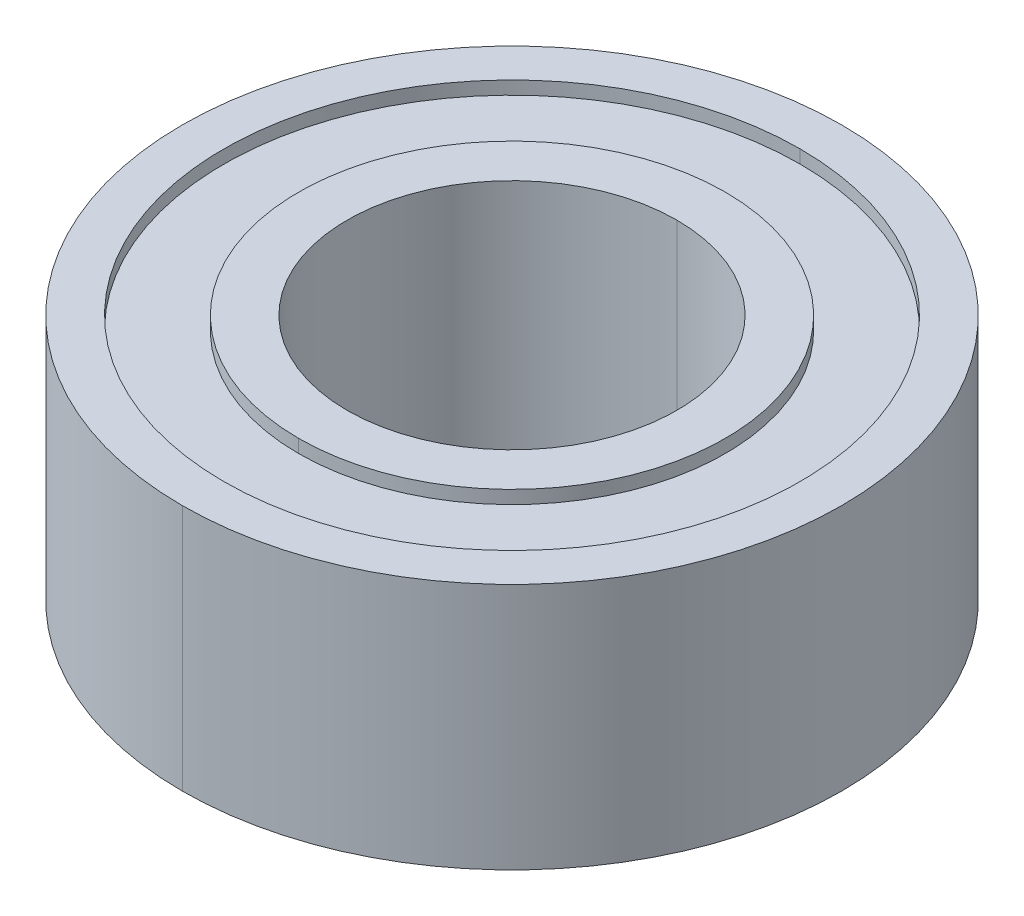
ISO-10303-21;
HEADER;
FILE_DESCRIPTION(('STEP AP214'),'2;1');
FILE_NAME('part.step','',(''),(''),'','','');
FILE_SCHEMA(('AUTOMOTIVE_DESIGN { 1 0 10303 214 1 1 1 1 }'));
ENDSEC;
DATA;
#1=APPLICATION_CONTEXT('core data for automotive mechanical design processes');
#2=APPLICATION_PROTOCOL_DEFINITION('international standard','automotive_design',2000,#1);
#3=PRODUCT_CONTEXT('',#1,'mechanical');
#4=PRODUCT('Part','Part','',(#3));
#5=PRODUCT_RELATED_PRODUCT_CATEGORY('part','',(#4));
#6=PRODUCT_DEFINITION_FORMATION('','',#4);
#7=PRODUCT_DEFINITION_CONTEXT('part definition',#1,'design');
#8=PRODUCT_DEFINITION('design','',#6,#7);
#9=PRODUCT_DEFINITION_SHAPE('','',#8);
#10=(LENGTH_UNIT() NAMED_UNIT(*) SI_UNIT(.MILLI.,.METRE.));
#11=(NAMED_UNIT(*) PLANE_ANGLE_UNIT() SI_UNIT($,.RADIAN.));
#12=(NAMED_UNIT(*) SI_UNIT($,.STERADIAN.) SOLID_ANGLE_UNIT());
#13=UNCERTAINTY_MEASURE_WITH_UNIT(LENGTH_MEASURE(1.E-05),#10,'distance_accuracy_value','');
#14=(GEOMETRIC_REPRESENTATION_CONTEXT(3) GLOBAL_UNCERTAINTY_ASSIGNED_CONTEXT((#13)) GLOBAL_UNIT_ASSIGNED_CONTEXT((#10,
#11,#12)) REPRESENTATION_CONTEXT('',''));
#15=CARTESIAN_POINT('',(0.,0.,0.));
#16=DIRECTION('',(0.,0.,1.));
#17=DIRECTION('',(1.,0.,0.));
#18=AXIS2_PLACEMENT_3D('',#15,#16,#17);
#19=CARTESIAN_POINT('',(0.,-2.12725,0.));
#20=DIRECTION('',(0.,-1.,0.));
#21=DIRECTION('',(0.,0.,-1.));
#22=AXIS2_PLACEMENT_3D('',#19,#20,#21);
#23=CYLINDRICAL_SURFACE('',#22,4.10845);
#24=DIRECTION('',(0.,-1.,0.));
#25=VECTOR('',#24,1.);
#26=CARTESIAN_POINT('',(0.,-2.12725,4.10845));
#27=LINE('',#26,#25);
#28=CARTESIAN_POINT('',(0.,-2.12725,4.10845));
#29=VERTEX_POINT('',#28);
#30=CARTESIAN_POINT('',(0.,-2.38125,4.10845));
#31=VERTEX_POINT('',#30);
#32=EDGE_CURVE('E216',#29,#31,#27,.T.);
#33=ORIENTED_EDGE('',*,*,#32,.F.);
#34=CARTESIAN_POINT('',(0.,-2.12725,0.));
#35=DIRECTION('',(0.,1.,0.));
#36=DIRECTION('',(0.,0.,1.));
#37=AXIS2_PLACEMENT_3D('',#34,#35,#36);
#38=CIRCLE('',#37,4.10845);
#39=CARTESIAN_POINT('',(0.,-2.12725,-4.10845));
#40=VERTEX_POINT('',#39);
#41=EDGE_CURVE('E11',#40,#29,#38,.T.);
#42=ORIENTED_EDGE('',*,*,#41,.F.);
#43=DIRECTION('',(0.,-1.,0.));
#44=VECTOR('',#43,1.);
#45=CARTESIAN_POINT('',(0.,-2.12725,-4.10845));
#46=LINE('',#45,#44);
#47=CARTESIAN_POINT('',(0.,-2.38125,-4.10845));
#48=VERTEX_POINT('',#47);
#49=EDGE_CURVE('E235',#40,#48,#46,.T.);
#50=ORIENTED_EDGE('',*,*,#49,.T.);
#51=CARTESIAN_POINT('',(0.,-2.38125,0.));
#52=DIRECTION('',(0.,1.,0.));
#53=DIRECTION('',(0.,0.,1.));
#54=AXIS2_PLACEMENT_3D('',#51,#52,#53);
#55=CIRCLE('',#54,4.10845);
#56=EDGE_CURVE('E139',#48,#31,#55,.T.);
#57=ORIENTED_EDGE('',*,*,#56,.T.);
#58=EDGE_LOOP('',(#33,#42,#50,#57));
#59=FACE_BOUND('',#58,.T.);
#60=ADVANCED_FACE('F16',(#59),#23,.T.);
#61=CARTESIAN_POINT('',(0.,-2.12725,0.));
#62=DIRECTION('',(0.,-1.,0.));
#63=DIRECTION('',(0.,0.,-1.));
#64=AXIS2_PLACEMENT_3D('',#61,#62,#63);
#65=CYLINDRICAL_SURFACE('',#64,5.5499);
#66=DIRECTION('',(0.,-1.,0.));
#67=VECTOR('',#66,1.);
#68=CARTESIAN_POINT('',(0.,-2.12725,5.5499));
#69=LINE('',#68,#67);
#70=CARTESIAN_POINT('',(0.,-2.12725,5.5499));
#71=VERTEX_POINT('',#70);
#72=CARTESIAN_POINT('',(0.,-2.38125,5.5499));
#73=VERTEX_POINT('',#72);
#74=EDGE_CURVE('E163',#71,#73,#69,.T.);
#75=ORIENTED_EDGE('',*,*,#74,.F.);
#76=CARTESIAN_POINT('',(0.,-2.12725,0.));
#77=DIRECTION('',(0.,1.,0.));
#78=DIRECTION('',(0.,0.,1.));
#79=AXIS2_PLACEMENT_3D('',#76,#77,#78);
#80=CIRCLE('',#79,5.5499);
#81=CARTESIAN_POINT('',(0.,-2.12725,-5.5499));
#82=VERTEX_POINT('',#81);
#83=EDGE_CURVE('E27',#71,#82,#80,.T.);
#84=ORIENTED_EDGE('',*,*,#83,.T.);
#85=DIRECTION('',(0.,-1.,0.));
#86=VECTOR('',#85,1.);
#87=CARTESIAN_POINT('',(0.,-2.12725,-5.5499));
#88=LINE('',#87,#86);
#89=CARTESIAN_POINT('',(0.,-2.38125,-5.5499));
#90=VERTEX_POINT('',#89);
#91=EDGE_CURVE('E211',#82,#90,#88,.T.);
#92=ORIENTED_EDGE('',*,*,#91,.T.);
#93=CARTESIAN_POINT('',(0.,-2.38125,0.));
#94=DIRECTION('',(0.,1.,0.));
#95=DIRECTION('',(0.,0.,1.));
#96=AXIS2_PLACEMENT_3D('',#93,#94,#95);
#97=CIRCLE('',#96,5.5499);
#98=EDGE_CURVE('E174',#73,#90,#97,.T.);
#99=ORIENTED_EDGE('',*,*,#98,.F.);
#100=EDGE_LOOP('',(#75,#84,#92,#99));
#101=FACE_BOUND('',#100,.T.);
#102=ADVANCED_FACE('F298',(#101),#65,.F.);
#103=CARTESIAN_POINT('',(0.,-2.12725,0.));
#104=DIRECTION('',(0.,-1.,0.));
#105=DIRECTION('',(0.,0.,-1.));
#106=AXIS2_PLACEMENT_3D('',#103,#104,#105);
#107=PLANE('',#106);
#108=ORIENTED_EDGE('',*,*,#41,.T.);
#109=CARTESIAN_POINT('',(0.,-2.12725,0.));
#110=DIRECTION('',(0.,1.,0.));
#111=DIRECTION('',(0.,0.,1.));
#112=AXIS2_PLACEMENT_3D('',#109,#110,#111);
#113=CIRCLE('',#112,4.10845);
#114=EDGE_CURVE('E212',#29,#40,#113,.T.);
#115=ORIENTED_EDGE('',*,*,#114,.T.);
#116=EDGE_LOOP('',(#108,#115));
#117=FACE_BOUND('',#116,.T.);
#118=CARTESIAN_POINT('',(0.,-2.12725,0.));
#119=DIRECTION('',(0.,1.,0.));
#120=DIRECTION('',(0.,0.,1.));
#121=AXIS2_PLACEMENT_3D('',#118,#119,#120);
#122=CIRCLE('',#121,5.5499);
#123=EDGE_CURVE('E238',#82,#71,#122,.T.);
#124=ORIENTED_EDGE('',*,*,#123,.F.);
#125=ORIENTED_EDGE('',*,*,#83,.F.);
#126=EDGE_LOOP('',(#124,#125));
#127=FACE_BOUND('',#126,.T.);
#128=ADVANCED_FACE('F303',(#117,#127),#107,.T.);
#129=CARTESIAN_POINT('',(0.,2.12725,0.));
#130=DIRECTION('',(0.,1.,0.));
#131=DIRECTION('',(0.,0.,1.));
#132=AXIS2_PLACEMENT_3D('',#129,#130,#131);
#133=CYLINDRICAL_SURFACE('',#132,4.10845);
#134=DIRECTION('',(0.,1.,0.));
#135=VECTOR('',#134,1.);
#136=CARTESIAN_POINT('',(0.,2.12725,-4.10845));
#137=LINE('',#136,#135);
#138=CARTESIAN_POINT('',(0.,2.12725,-4.10845));
#139=VERTEX_POINT('',#138);
#140=CARTESIAN_POINT('',(0.,2.38125,-4.10845));
#141=VERTEX_POINT('',#140);
#142=EDGE_CURVE('E199',#139,#141,#137,.T.);
#143=ORIENTED_EDGE('',*,*,#142,.F.);
#144=CARTESIAN_POINT('',(0.,2.12725,0.));
#145=DIRECTION('',(0.,1.,0.));
#146=DIRECTION('',(0.,0.,1.));
#147=AXIS2_PLACEMENT_3D('',#144,#145,#146);
#148=CIRCLE('',#147,4.10845);
#149=CARTESIAN_POINT('',(0.,2.12725,4.10845));
#150=VERTEX_POINT('',#149);
#151=EDGE_CURVE('E217',#139,#150,#148,.T.);
#152=ORIENTED_EDGE('',*,*,#151,.T.);
#153=DIRECTION('',(0.,1.,0.));
#154=VECTOR('',#153,1.);
#155=CARTESIAN_POINT('',(0.,2.12725,4.10845));
#156=LINE('',#155,#154);
#157=CARTESIAN_POINT('',(0.,2.38125,4.10845));
#158=VERTEX_POINT('',#157);
#159=EDGE_CURVE('E220',#150,#158,#156,.T.);
#160=ORIENTED_EDGE('',*,*,#159,.T.);
#161=CARTESIAN_POINT('',(0.,2.38125,0.));
#162=DIRECTION('',(0.,1.,0.));
#163=DIRECTION('',(0.,0.,1.));
#164=AXIS2_PLACEMENT_3D('',#161,#162,#163);
#165=CIRCLE('',#164,4.10845);
#166=EDGE_CURVE('E176',#141,#158,#165,.T.);
#167=ORIENTED_EDGE('',*,*,#166,.F.);
#168=EDGE_LOOP('',(#143,#152,#160,#167));
#169=FACE_BOUND('',#168,.T.);
#170=ADVANCED_FACE('F386',(#169),#133,.T.);
#171=CARTESIAN_POINT('',(0.,2.12725,0.));
#172=DIRECTION('',(0.,1.,0.));
#173=DIRECTION('',(1.,0.,0.));
#174=AXIS2_PLACEMENT_3D('',#171,#172,#173);
#175=PLANE('',#174);
#176=CARTESIAN_POINT('',(0.,2.12725,0.));
#177=DIRECTION('',(0.,1.,0.));
#178=DIRECTION('',(0.,0.,1.));
#179=AXIS2_PLACEMENT_3D('',#176,#177,#178);
#180=CIRCLE('',#179,4.10845);
#181=EDGE_CURVE('E203',#150,#139,#180,.T.);
#182=ORIENTED_EDGE('',*,*,#181,.F.);
#183=ORIENTED_EDGE('',*,*,#151,.F.);
#184=EDGE_LOOP('',(#182,#183));
#185=FACE_BOUND('',#184,.T.);
#186=CARTESIAN_POINT('',(0.,2.12725,0.));
#187=DIRECTION('',(0.,1.,0.));
#188=DIRECTION('',(0.,0.,1.));
#189=AXIS2_PLACEMENT_3D('',#186,#187,#188);
#190=CIRCLE('',#189,5.5499);
#191=CARTESIAN_POINT('',(0.,2.12725,5.5499));
#192=VERTEX_POINT('',#191);
#193=CARTESIAN_POINT('',(0.,2.12725,-5.5499));
#194=VERTEX_POINT('',#193);
#195=EDGE_CURVE('E138',#192,#194,#190,.T.);
#196=ORIENTED_EDGE('',*,*,#195,.T.);
#197=CARTESIAN_POINT('',(0.,2.12725,0.));
#198=DIRECTION('',(0.,1.,0.));
#199=DIRECTION('',(0.,0.,1.));
#200=AXIS2_PLACEMENT_3D('',#197,#198,#199);
#201=CIRCLE('',#200,5.5499);
#202=EDGE_CURVE('E198',#194,#192,#201,.T.);
#203=ORIENTED_EDGE('',*,*,#202,.T.);
#204=EDGE_LOOP('',(#196,#203));
#205=FACE_BOUND('',#204,.T.);
#206=ADVANCED_FACE('F382',(#185,#205),#175,.T.);
#207=CARTESIAN_POINT('',(0.,2.12725,0.));
#208=DIRECTION('',(0.,1.,0.));
#209=DIRECTION('',(0.,0.,1.));
#210=AXIS2_PLACEMENT_3D('',#207,#208,#209);
#211=CYLINDRICAL_SURFACE('',#210,5.5499);
#212=DIRECTION('',(0.,1.,0.));
#213=VECTOR('',#212,1.);
#214=CARTESIAN_POINT('',(0.,2.12725,-5.5499));
#215=LINE('',#214,#213);
#216=CARTESIAN_POINT('',(0.,2.38125,-5.5499));
#217=VERTEX_POINT('',#216);
#218=EDGE_CURVE('E173',#194,#217,#215,.T.);
#219=ORIENTED_EDGE('',*,*,#218,.F.);
#220=ORIENTED_EDGE('',*,*,#195,.F.);
#221=DIRECTION('',(0.,1.,0.));
#222=VECTOR('',#221,1.);
#223=CARTESIAN_POINT('',(0.,2.12725,5.5499));
#224=LINE('',#223,#222);
#225=CARTESIAN_POINT('',(0.,2.38125,5.5499));
#226=VERTEX_POINT('',#225);
#227=EDGE_CURVE('E172',#192,#226,#224,.T.);
#228=ORIENTED_EDGE('',*,*,#227,.T.);
#229=CARTESIAN_POINT('',(0.,2.38125,0.));
#230=DIRECTION('',(0.,1.,0.));
#231=DIRECTION('',(0.,0.,1.));
#232=AXIS2_PLACEMENT_3D('',#229,#230,#231);
#233=CIRCLE('',#232,5.5499);
#234=EDGE_CURVE('E166',#226,#217,#233,.T.);
#235=ORIENTED_EDGE('',*,*,#234,.T.);
#236=EDGE_LOOP('',(#219,#220,#228,#235));
#237=FACE_BOUND('',#236,.T.);
#238=ADVANCED_FACE('F308',(#237),#211,.F.);
#239=CARTESIAN_POINT('',(0.,2.38125,0.));
#240=DIRECTION('',(0.,-1.,0.));
#241=DIRECTION('',(0.,0.,-1.));
#242=AXIS2_PLACEMENT_3D('',#239,#240,#241);
#243=CYLINDRICAL_SURFACE('',#242,3.175);
#244=DIRECTION('',(0.,-1.,0.));
#245=VECTOR('',#244,1.);
#246=CARTESIAN_POINT('',(0.,2.38125,3.175));
#247=LINE('',#246,#245);
#248=CARTESIAN_POINT('',(0.,2.38125,3.175));
#249=VERTEX_POINT('',#248);
#250=CARTESIAN_POINT('',(0.,-2.38125,3.175));
#251=VERTEX_POINT('',#250);
#252=EDGE_CURVE('E151',#249,#251,#247,.T.);
#253=ORIENTED_EDGE('',*,*,#252,.F.);
#254=CARTESIAN_POINT('',(0.,2.38125,0.));
#255=DIRECTION('',(0.,1.,0.));
#256=DIRECTION('',(0.,0.,1.));
#257=AXIS2_PLACEMENT_3D('',#254,#255,#256);
#258=CIRCLE('',#257,3.175);
#259=CARTESIAN_POINT('',(0.,2.38125,-3.175));
#260=VERTEX_POINT('',#259);
#261=EDGE_CURVE('E20',#249,#260,#258,.T.);
#262=ORIENTED_EDGE('',*,*,#261,.T.);
#263=DIRECTION('',(0.,-1.,0.));
#264=VECTOR('',#263,1.);
#265=CARTESIAN_POINT('',(0.,2.38125,-3.175));
#266=LINE('',#265,#264);
#267=CARTESIAN_POINT('',(0.,-2.38125,-3.175));
#268=VERTEX_POINT('',#267);
#269=EDGE_CURVE('E142',#260,#268,#266,.T.);
#270=ORIENTED_EDGE('',*,*,#269,.T.);
#271=CARTESIAN_POINT('',(0.,-2.38125,0.));
#272=DIRECTION('',(0.,1.,0.));
#273=DIRECTION('',(0.,0.,1.));
#274=AXIS2_PLACEMENT_3D('',#271,#272,#273);
#275=CIRCLE('',#274,3.175);
#276=EDGE_CURVE('E128',#251,#268,#275,.T.);
#277=ORIENTED_EDGE('',*,*,#276,.F.);
#278=EDGE_LOOP('',(#253,#262,#270,#277));
#279=FACE_BOUND('',#278,.T.);
#280=ADVANCED_FACE('F143',(#279),#243,.F.);
#281=CARTESIAN_POINT('',(0.,2.38125,0.));
#282=DIRECTION('',(0.,-1.,0.));
#283=DIRECTION('',(0.,0.,-1.));
#284=AXIS2_PLACEMENT_3D('',#281,#282,#283);
#285=CYLINDRICAL_SURFACE('',#284,6.35);
#286=DIRECTION('',(0.,-1.,0.));
#287=VECTOR('',#286,1.);
#288=CARTESIAN_POINT('',(0.,2.38125,6.35));
#289=LINE('',#288,#287);
#290=CARTESIAN_POINT('',(0.,2.38125,6.35));
#291=VERTEX_POINT('',#290);
#292=CARTESIAN_POINT('',(0.,-2.38125,6.35));
#293=VERTEX_POINT('',#292);
#294=EDGE_CURVE('E207',#291,#293,#289,.T.);
#295=ORIENTED_EDGE('',*,*,#294,.F.);
#296=CARTESIAN_POINT('',(0.,2.38125,0.));
#297=DIRECTION('',(0.,1.,0.));
#298=DIRECTION('',(0.,0.,1.));
#299=AXIS2_PLACEMENT_3D('',#296,#297,#298);
#300=CIRCLE('',#299,6.35);
#301=CARTESIAN_POINT('',(0.,2.38125,-6.35));
#302=VERTEX_POINT('',#301);
#303=EDGE_CURVE('E165',#302,#291,#300,.T.);
#304=ORIENTED_EDGE('',*,*,#303,.F.);
#305=DIRECTION('',(0.,-1.,0.));
#306=VECTOR('',#305,1.);
#307=CARTESIAN_POINT('',(0.,2.38125,-6.35));
#308=LINE('',#307,#306);
#309=CARTESIAN_POINT('',(0.,-2.38125,-6.35));
#310=VERTEX_POINT('',#309);
#311=EDGE_CURVE('E185',#302,#310,#308,.T.);
#312=ORIENTED_EDGE('',*,*,#311,.T.);
#313=CARTESIAN_POINT('',(0.,-2.38125,0.));
#314=DIRECTION('',(0.,1.,0.));
#315=DIRECTION('',(0.,0.,1.));
#316=AXIS2_PLACEMENT_3D('',#313,#314,#315);
#317=CIRCLE('',#316,6.35);
#318=EDGE_CURVE('E40',#310,#293,#317,.T.);
#319=ORIENTED_EDGE('',*,*,#318,.T.);
#320=EDGE_LOOP('',(#295,#304,#312,#319));
#321=FACE_BOUND('',#320,.T.);
#322=ADVANCED_FACE('F18',(#321),#285,.T.);
#323=CARTESIAN_POINT('',(0.,-2.38125,0.));
#324=DIRECTION('',(0.,1.,0.));
#325=DIRECTION('',(1.,0.,0.));
#326=AXIS2_PLACEMENT_3D('',#323,#324,#325);
#327=PLANE('',#326);
#328=CARTESIAN_POINT('',(0.,-2.38125,0.));
#329=DIRECTION('',(0.,1.,0.));
#330=DIRECTION('',(0.,0.,1.));
#331=AXIS2_PLACEMENT_3D('',#328,#329,#330);
#332=CIRCLE('',#331,3.175);
#333=EDGE_CURVE('E133',#268,#251,#332,.T.);
#334=ORIENTED_EDGE('',*,*,#333,.T.);
#335=ORIENTED_EDGE('',*,*,#276,.T.);
#336=EDGE_LOOP('',(#334,#335));
#337=FACE_BOUND('',#336,.T.);
#338=ORIENTED_EDGE('',*,*,#56,.F.);
#339=CARTESIAN_POINT('',(0.,-2.38125,0.));
#340=DIRECTION('',(0.,1.,0.));
#341=DIRECTION('',(0.,0.,1.));
#342=AXIS2_PLACEMENT_3D('',#339,#340,#341);
#343=CIRCLE('',#342,4.10845);
#344=EDGE_CURVE('E239',#31,#48,#343,.T.);
#345=ORIENTED_EDGE('',*,*,#344,.F.);
#346=EDGE_LOOP('',(#338,#345));
#347=FACE_BOUND('',#346,.T.);
#348=ADVANCED_FACE('F130',(#337,#347),#327,.F.);
#349=CARTESIAN_POINT('',(0.,2.38125,0.));
#350=DIRECTION('',(0.,1.,0.));
#351=DIRECTION('',(1.,0.,0.));
#352=AXIS2_PLACEMENT_3D('',#349,#350,#351);
#353=PLANE('',#352);
#354=ORIENTED_EDGE('',*,*,#234,.F.);
#355=CARTESIAN_POINT('',(0.,2.38125,0.));
#356=DIRECTION('',(0.,1.,0.));
#357=DIRECTION('',(0.,0.,1.));
#358=AXIS2_PLACEMENT_3D('',#355,#356,#357);
#359=CIRCLE('',#358,5.5499);
#360=EDGE_CURVE('E168',#217,#226,#359,.T.);
#361=ORIENTED_EDGE('',*,*,#360,.F.);
#362=EDGE_LOOP('',(#354,#361));
#363=FACE_BOUND('',#362,.T.);
#364=ORIENTED_EDGE('',*,*,#303,.T.);
#365=CARTESIAN_POINT('',(0.,2.38125,0.));
#366=DIRECTION('',(0.,1.,0.));
#367=DIRECTION('',(0.,0.,1.));
#368=AXIS2_PLACEMENT_3D('',#365,#366,#367);
#369=CIRCLE('',#368,6.35);
#370=EDGE_CURVE('E149',#291,#302,#369,.T.);
#371=ORIENTED_EDGE('',*,*,#370,.T.);
#372=EDGE_LOOP('',(#364,#371));
#373=FACE_BOUND('',#372,.T.);
#374=ADVANCED_FACE('F281',(#363,#373),#353,.T.);
#375=CARTESIAN_POINT('',(0.,2.38125,0.));
#376=DIRECTION('',(0.,1.,0.));
#377=DIRECTION('',(1.,0.,0.));
#378=AXIS2_PLACEMENT_3D('',#375,#376,#377);
#379=PLANE('',#378);
#380=CARTESIAN_POINT('',(0.,2.38125,0.));
#381=DIRECTION('',(0.,1.,0.));
#382=DIRECTION('',(0.,0.,1.));
#383=AXIS2_PLACEMENT_3D('',#380,#381,#382);
#384=CIRCLE('',#383,3.175);
#385=EDGE_CURVE('E159',#260,#249,#384,.T.);
#386=ORIENTED_EDGE('',*,*,#385,.F.);
#387=ORIENTED_EDGE('',*,*,#261,.F.);
#388=EDGE_LOOP('',(#386,#387));
#389=FACE_BOUND('',#388,.T.);
#390=CARTESIAN_POINT('',(0.,2.38125,0.));
#391=DIRECTION('',(0.,1.,0.));
#392=DIRECTION('',(0.,0.,1.));
#393=AXIS2_PLACEMENT_3D('',#390,#391,#392);
#394=CIRCLE('',#393,4.10845);
#395=EDGE_CURVE('E202',#158,#141,#394,.T.);
#396=ORIENTED_EDGE('',*,*,#395,.T.);
#397=ORIENTED_EDGE('',*,*,#166,.T.);
#398=EDGE_LOOP('',(#396,#397));
#399=FACE_BOUND('',#398,.T.);
#400=ADVANCED_FACE('F283',(#389,#399),#379,.T.);
#401=CARTESIAN_POINT('',(0.,-2.38125,0.));
#402=DIRECTION('',(0.,1.,0.));
#403=DIRECTION('',(1.,0.,0.));
#404=AXIS2_PLACEMENT_3D('',#401,#402,#403);
#405=PLANE('',#404);
#406=CARTESIAN_POINT('',(0.,-2.38125,0.));
#407=DIRECTION('',(0.,1.,0.));
#408=DIRECTION('',(0.,0.,1.));
#409=AXIS2_PLACEMENT_3D('',#406,#407,#408);
#410=CIRCLE('',#409,5.5499);
#411=EDGE_CURVE('E263',#90,#73,#410,.T.);
#412=ORIENTED_EDGE('',*,*,#411,.T.);
#413=ORIENTED_EDGE('',*,*,#98,.T.);
#414=EDGE_LOOP('',(#412,#413));
#415=FACE_BOUND('',#414,.T.);
#416=ORIENTED_EDGE('',*,*,#318,.F.);
#417=CARTESIAN_POINT('',(0.,-2.38125,0.));
#418=DIRECTION('',(0.,1.,0.));
#419=DIRECTION('',(0.,0.,1.));
#420=AXIS2_PLACEMENT_3D('',#417,#418,#419);
#421=CIRCLE('',#420,6.35);
#422=EDGE_CURVE('E194',#293,#310,#421,.T.);
#423=ORIENTED_EDGE('',*,*,#422,.F.);
#424=EDGE_LOOP('',(#416,#423));
#425=FACE_BOUND('',#424,.T.);
#426=ADVANCED_FACE('F291',(#415,#425),#405,.F.);
#427=CARTESIAN_POINT('',(0.,2.38125,0.));
#428=DIRECTION('',(0.,-1.,0.));
#429=DIRECTION('',(0.,0.,-1.));
#430=AXIS2_PLACEMENT_3D('',#427,#428,#429);
#431=CYLINDRICAL_SURFACE('',#430,6.35);
#432=ORIENTED_EDGE('',*,*,#370,.F.);
#433=ORIENTED_EDGE('',*,*,#294,.T.);
#434=ORIENTED_EDGE('',*,*,#422,.T.);
#435=ORIENTED_EDGE('',*,*,#311,.F.);
#436=EDGE_LOOP('',(#432,#433,#434,#435));
#437=FACE_BOUND('',#436,.T.);
#438=ADVANCED_FACE('F278',(#437),#431,.T.);
#439=CARTESIAN_POINT('',(0.,2.38125,0.));
#440=DIRECTION('',(0.,-1.,0.));
#441=DIRECTION('',(0.,0.,-1.));
#442=AXIS2_PLACEMENT_3D('',#439,#440,#441);
#443=CYLINDRICAL_SURFACE('',#442,3.175);
#444=ORIENTED_EDGE('',*,*,#385,.T.);
#445=ORIENTED_EDGE('',*,*,#252,.T.);
#446=ORIENTED_EDGE('',*,*,#333,.F.);
#447=ORIENTED_EDGE('',*,*,#269,.F.);
#448=EDGE_LOOP('',(#444,#445,#446,#447));
#449=FACE_BOUND('',#448,.T.);
#450=ADVANCED_FACE('F150',(#449),#443,.F.);
#451=CARTESIAN_POINT('',(0.,2.12725,0.));
#452=DIRECTION('',(0.,1.,0.));
#453=DIRECTION('',(0.,0.,1.));
#454=AXIS2_PLACEMENT_3D('',#451,#452,#453);
#455=CYLINDRICAL_SURFACE('',#454,5.5499);
#456=ORIENTED_EDGE('',*,*,#202,.F.);
#457=ORIENTED_EDGE('',*,*,#218,.T.);
#458=ORIENTED_EDGE('',*,*,#360,.T.);
#459=ORIENTED_EDGE('',*,*,#227,.F.);
#460=EDGE_LOOP('',(#456,#457,#458,#459));
#461=FACE_BOUND('',#460,.T.);
#462=ADVANCED_FACE('F310',(#461),#455,.F.);
#463=CARTESIAN_POINT('',(0.,2.12725,0.));
#464=DIRECTION('',(0.,1.,0.));
#465=DIRECTION('',(0.,0.,1.));
#466=AXIS2_PLACEMENT_3D('',#463,#464,#465);
#467=CYLINDRICAL_SURFACE('',#466,4.10845);
#468=ORIENTED_EDGE('',*,*,#181,.T.);
#469=ORIENTED_EDGE('',*,*,#142,.T.);
#470=ORIENTED_EDGE('',*,*,#395,.F.);
#471=ORIENTED_EDGE('',*,*,#159,.F.);
#472=EDGE_LOOP('',(#468,#469,#470,#471));
#473=FACE_BOUND('',#472,.T.);
#474=ADVANCED_FACE('F312',(#473),#467,.T.);
#475=CARTESIAN_POINT('',(0.,-2.12725,0.));
#476=DIRECTION('',(0.,-1.,0.));
#477=DIRECTION('',(0.,0.,-1.));
#478=AXIS2_PLACEMENT_3D('',#475,#476,#477);
#479=CYLINDRICAL_SURFACE('',#478,5.5499);
#480=ORIENTED_EDGE('',*,*,#123,.T.);
#481=ORIENTED_EDGE('',*,*,#74,.T.);
#482=ORIENTED_EDGE('',*,*,#411,.F.);
#483=ORIENTED_EDGE('',*,*,#91,.F.);
#484=EDGE_LOOP('',(#480,#481,#482,#483));
#485=FACE_BOUND('',#484,.T.);
#486=ADVANCED_FACE('F327',(#485),#479,.F.);
#487=CARTESIAN_POINT('',(0.,-2.12725,0.));
#488=DIRECTION('',(0.,-1.,0.));
#489=DIRECTION('',(0.,0.,-1.));
#490=AXIS2_PLACEMENT_3D('',#487,#488,#489);
#491=CYLINDRICAL_SURFACE('',#490,4.10845);
#492=ORIENTED_EDGE('',*,*,#114,.F.);
#493=ORIENTED_EDGE('',*,*,#32,.T.);
#494=ORIENTED_EDGE('',*,*,#344,.T.);
#495=ORIENTED_EDGE('',*,*,#49,.F.);
#496=EDGE_LOOP('',(#492,#493,#494,#495));
#497=FACE_BOUND('',#496,.T.);
#498=ADVANCED_FACE('F362',(#497),#491,.T.);
#499=CLOSED_SHELL('',(#60,#102,#128,#170,#206,#238,#280,#322,#348,#374,#400,#426,#438,#450,#462,
#474,#486,#498));
#500=MANIFOLD_SOLID_BREP('B1',#499);
#501=ADVANCED_BREP_SHAPE_REPRESENTATION('',(#18,#500),#14);
#502=SHAPE_DEFINITION_REPRESENTATION(#9,#501);
ENDSEC;
END-ISO-10303-21;
